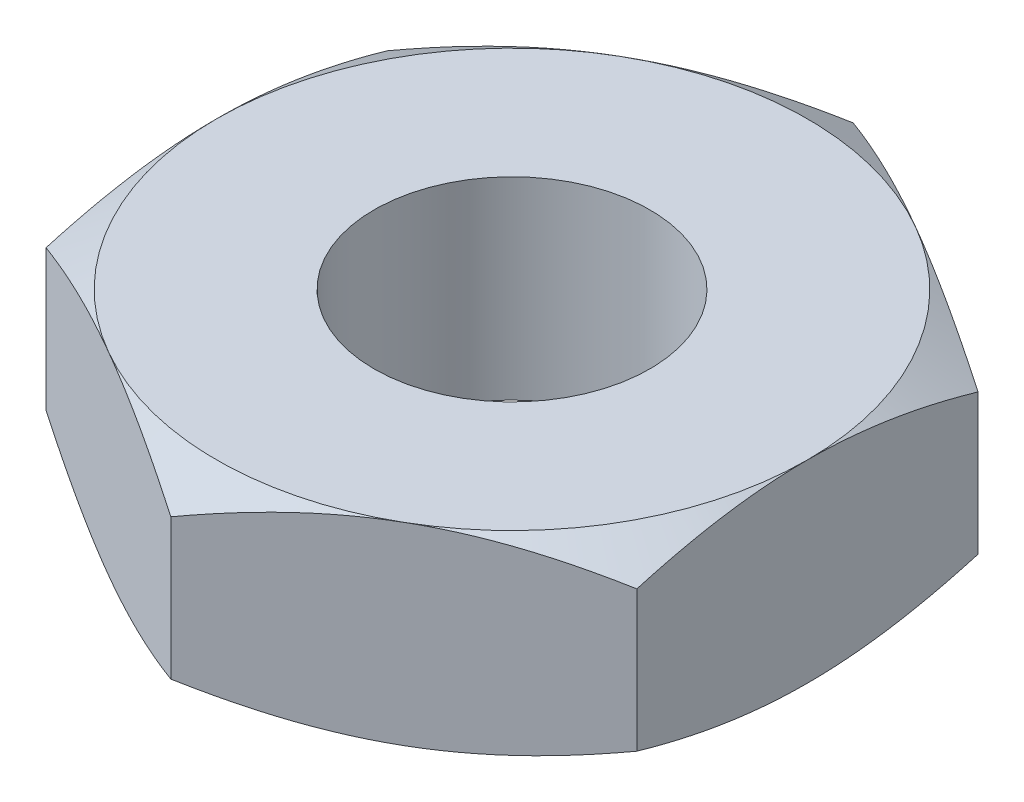
ISO-10303-21;
HEADER;
FILE_DESCRIPTION(('STEP AP214'),'2;1');
FILE_NAME('part.step','',(''),(''),'','','');
FILE_SCHEMA(('AUTOMOTIVE_DESIGN { 1 0 10303 214 1 1 1 1 }'));
ENDSEC;
DATA;
#1=APPLICATION_CONTEXT('core data for automotive mechanical design processes');
#2=APPLICATION_PROTOCOL_DEFINITION('international standard','automotive_design',2000,#1);
#3=PRODUCT_CONTEXT('',#1,'mechanical');
#4=PRODUCT('Part','Part','',(#3));
#5=PRODUCT_RELATED_PRODUCT_CATEGORY('part','',(#4));
#6=PRODUCT_DEFINITION_FORMATION('','',#4);
#7=PRODUCT_DEFINITION_CONTEXT('part definition',#1,'design');
#8=PRODUCT_DEFINITION('design','',#6,#7);
#9=PRODUCT_DEFINITION_SHAPE('','',#8);
#10=(LENGTH_UNIT() NAMED_UNIT(*) SI_UNIT(.MILLI.,.METRE.));
#11=(NAMED_UNIT(*) PLANE_ANGLE_UNIT() SI_UNIT($,.RADIAN.));
#12=(NAMED_UNIT(*) SI_UNIT($,.STERADIAN.) SOLID_ANGLE_UNIT());
#13=UNCERTAINTY_MEASURE_WITH_UNIT(LENGTH_MEASURE(1.E-05),#10,'distance_accuracy_value','');
#14=(GEOMETRIC_REPRESENTATION_CONTEXT(3) GLOBAL_UNCERTAINTY_ASSIGNED_CONTEXT((#13)) GLOBAL_UNIT_ASSIGNED_CONTEXT((#10,
#11,#12)) REPRESENTATION_CONTEXT('',''));
#15=CARTESIAN_POINT('',(0.,0.,0.));
#16=DIRECTION('',(0.,0.,1.));
#17=DIRECTION('',(1.,0.,0.));
#18=AXIS2_PLACEMENT_3D('',#15,#16,#17);
#19=CARTESIAN_POINT('',(2.75,1.8,-1.58771324027147));
#20=DIRECTION('',(-0.5,0.,0.866025403784439));
#21=DIRECTION('',(0.866025403784439,0.,0.5));
#22=AXIS2_PLACEMENT_3D('',#19,#20,#21);
#23=PLANE('',#22);
#24=DIRECTION('',(0.,-1.,0.));
#25=VECTOR('',#24,1.);
#26=CARTESIAN_POINT('',(2.75,1.8,-1.58771324027147));
#27=LINE('',#26,#25);
#28=CARTESIAN_POINT('',(2.75,1.55437990693814,-1.58771324027147));
#29=VERTEX_POINT('',#28);
#30=CARTESIAN_POINT('',(2.75,0.245620093061858,-1.58771324027147));
#31=VERTEX_POINT('',#30);
#32=EDGE_CURVE('E159',#29,#31,#27,.T.);
#33=ORIENTED_EDGE('',*,*,#32,.T.);
#34=CARTESIAN_POINT('',(2.7502,0.245686763364757,-1.58759777021763));
#35=CARTESIAN_POINT('',(2.62935077934009,0.20538766224926,-1.65737010029698));
#36=CARTESIAN_POINT('',(2.50745839737737,0.168736902597659,-1.72774469983533));
#37=CARTESIAN_POINT('',(2.26156287327211,0.104762182969799,-1.86971254687002));
#38=CARTESIAN_POINT('',(2.13755536142615,0.0774608556744955,-1.94130831721583));
#39=CARTESIAN_POINT('',(1.89107720202406,0.0349617452941153,-2.08361254889599));
#40=CARTESIAN_POINT('',(1.76864448141258,0.0194811186224564,-2.15429911309864));
#41=CARTESIAN_POINT('',(1.52320285763109,0.00099939736993891,-2.29600490065922));
#42=CARTESIAN_POINT('',(1.40019484676709,-0.00201700053740207,-2.36702360884403));
#43=CARTESIAN_POINT('',(1.17034121338921,0.00425314542854469,-2.49972966594897));
#44=CARTESIAN_POINT('',(1.06346120874598,0.0120001542767004,-2.56143686540072));
#45=CARTESIAN_POINT('',(0.850397532665252,0.0365551810643526,-2.68444923614046));
#46=CARTESIAN_POINT('',(0.744214598351112,0.053371589650568,-2.74575398185008));
#47=CARTESIAN_POINT('',(0.530711510606817,0.0954119223459535,-2.86902004703206));
#48=CARTESIAN_POINT('',(0.423418383857145,0.120814080687228,-2.93096576264318));
#49=CARTESIAN_POINT('',(0.210432520715949,0.178467225839978,-3.05393320806133));
#50=CARTESIAN_POINT('',(0.104737054973347,0.210704663298978,-3.11495651365995));
#51=CARTESIAN_POINT('',(-0.000200000000000443,0.245686763364756,-3.17554195059678));
#52=B_SPLINE_CURVE_WITH_KNOTS('',3,(#34,#35,#36,#37,#38,#39,#40,#41,#42,#43,#44,#45,#46,#47,#48,
#49,#50,#51),.UNSPECIFIED.,.F.,.F.,(4,2,2,2,2,2,2,2,4),(0.,0.435912828725887,0.87287355711633,
1.29901931904671,1.72464171213573,2.09526089052937,2.46622354066374,2.84541551798557,
3.22386274754524),.UNSPECIFIED.);
#53=CARTESIAN_POINT('',(1.375,0.,-2.38156986040721));
#54=VERTEX_POINT('',#53);
#55=EDGE_CURVE('E62',#31,#54,#52,.T.);
#56=ORIENTED_EDGE('',*,*,#55,.T.);
#57=CARTESIAN_POINT('',(0.,0.245620093061858,-3.17542648054294));
#58=VERTEX_POINT('',#57);
#59=EDGE_CURVE('E129',#54,#58,#52,.T.);
#60=ORIENTED_EDGE('',*,*,#59,.T.);
#61=DIRECTION('',(0.,-1.,0.));
#62=VECTOR('',#61,1.);
#63=CARTESIAN_POINT('',(0.,1.8,-3.17542648054294));
#64=LINE('',#63,#62);
#65=CARTESIAN_POINT('',(0.,1.55437990693814,-3.17542648054294));
#66=VERTEX_POINT('',#65);
#67=EDGE_CURVE('E267',#66,#58,#64,.T.);
#68=ORIENTED_EDGE('',*,*,#67,.F.);
#69=CARTESIAN_POINT('',(-0.000200000000000084,1.55431323663524,-3.17554195059678));
#70=CARTESIAN_POINT('',(0.120649220659906,1.59461233775074,-3.10576962051742));
#71=CARTESIAN_POINT('',(0.242541602622633,1.63126309740234,-3.03539502097908));
#72=CARTESIAN_POINT('',(0.488437126727892,1.6952378170302,-2.89342717394438));
#73=CARTESIAN_POINT('',(0.612444638573855,1.72253914432551,-2.82183140359858));
#74=CARTESIAN_POINT('',(0.858922797975943,1.76503825470589,-2.67952717191842));
#75=CARTESIAN_POINT('',(0.981355518587416,1.78051888137754,-2.60884060771577));
#76=CARTESIAN_POINT('',(1.22679714236891,1.79900060263006,-2.46713482015518));
#77=CARTESIAN_POINT('',(1.34980515323291,1.8020170005374,-2.39611611197037));
#78=CARTESIAN_POINT('',(1.57965878661079,1.79574685457146,-2.26341005486544));
#79=CARTESIAN_POINT('',(1.68653879125402,1.7879998457233,-2.20170285541368));
#80=CARTESIAN_POINT('',(1.89960246733475,1.76344481893565,-2.07869048467394));
#81=CARTESIAN_POINT('',(2.00578540164889,1.74662841034943,-2.01738573896433));
#82=CARTESIAN_POINT('',(2.21928848939318,1.70458807765405,-1.89411967378235));
#83=CARTESIAN_POINT('',(2.32658161614285,1.67918591931277,-1.83217395817123));
#84=CARTESIAN_POINT('',(2.53956747928405,1.62153277416002,-1.70920651275307));
#85=CARTESIAN_POINT('',(2.64526294502665,1.58929533670102,-1.64818320715446));
#86=CARTESIAN_POINT('',(2.7502,1.55431323663524,-1.58759777021763));
#87=B_SPLINE_CURVE_WITH_KNOTS('',3,(#69,#70,#71,#72,#73,#74,#75,#76,#77,#78,#79,#80,#81,#82,#83,
#84,#85,#86),.UNSPECIFIED.,.F.,.F.,(4,2,2,2,2,2,2,2,4),(0.,0.435912828725887,0.872873557116331,
1.29901931904671,1.72464171213573,2.09526089052937,2.46622354066374,2.84541551798557,
3.22386274754524),.UNSPECIFIED.);
#88=CARTESIAN_POINT('',(1.375,1.8,-2.38156986040721));
#89=VERTEX_POINT('',#88);
#90=EDGE_CURVE('E299',#66,#89,#87,.T.);
#91=ORIENTED_EDGE('',*,*,#90,.T.);
#92=EDGE_CURVE('E308',#89,#29,#87,.T.);
#93=ORIENTED_EDGE('',*,*,#92,.T.);
#94=EDGE_LOOP('',(#33,#56,#60,#68,#91,#93));
#95=FACE_BOUND('',#94,.T.);
#96=ADVANCED_FACE('F39',(#95),#23,.F.);
#97=CARTESIAN_POINT('',(0.,1.8,-3.17542648054294));
#98=DIRECTION('',(0.5,0.,0.866025403784439));
#99=DIRECTION('',(0.866025403784439,0.,-0.5));
#100=AXIS2_PLACEMENT_3D('',#97,#98,#99);
#101=PLANE('',#100);
#102=ORIENTED_EDGE('',*,*,#67,.T.);
#103=CARTESIAN_POINT('',(0.000199999999999961,0.245686763364756,-3.17554195059678));
#104=CARTESIAN_POINT('',(-0.120649220659906,0.205387662249259,-3.10576962051742));
#105=CARTESIAN_POINT('',(-0.242541602622633,0.168736902597659,-3.03539502097908));
#106=CARTESIAN_POINT('',(-0.488437126727892,0.104762182969798,-2.89342717394438));
#107=CARTESIAN_POINT('',(-0.612444638573855,0.0774608556744951,-2.82183140359858));
#108=CARTESIAN_POINT('',(-0.858922797975942,0.034961745294115,-2.67952717191842));
#109=CARTESIAN_POINT('',(-0.981355518587416,0.019481118622456,-2.60884060771577));
#110=CARTESIAN_POINT('',(-1.22679714236891,0.000999397369938881,-2.46713482015518));
#111=CARTESIAN_POINT('',(-1.34980515323291,-0.00201700053740175,-2.39611611197037));
#112=CARTESIAN_POINT('',(-1.57965878661079,0.00425314542854518,-2.26341005486544));
#113=CARTESIAN_POINT('',(-1.68653879125402,0.0120001542767007,-2.20170285541369));
#114=CARTESIAN_POINT('',(-1.89960246733475,0.0365551810643529,-2.07869048467395));
#115=CARTESIAN_POINT('',(-2.00578540164889,0.0533715896505683,-2.01738573896433));
#116=CARTESIAN_POINT('',(-2.21928848939318,0.0954119223459539,-1.89411967378235));
#117=CARTESIAN_POINT('',(-2.32658161614285,0.120814080687228,-1.83217395817123));
#118=CARTESIAN_POINT('',(-2.53956747928405,0.178467225839979,-1.70920651275307));
#119=CARTESIAN_POINT('',(-2.64526294502665,0.210704663298979,-1.64818320715446));
#120=CARTESIAN_POINT('',(-2.7502,0.245686763364757,-1.58759777021763));
#121=B_SPLINE_CURVE_WITH_KNOTS('',3,(#103,#104,#105,#106,#107,#108,#109,#110,#111,#112,#113,
#114,#115,#116,#117,#118,#119,#120),.UNSPECIFIED.,.F.,.F.,(4,2,2,2,2,2,2,2,4),(0.,
0.435912828725887,0.87287355711633,1.29901931904671,1.72464171213573,2.09526089052937,
2.46622354066374,2.84541551798557,3.22386274754524),.UNSPECIFIED.);
#122=CARTESIAN_POINT('',(-1.375,0.,-2.38156986040721));
#123=VERTEX_POINT('',#122);
#124=EDGE_CURVE('E135',#58,#123,#121,.T.);
#125=ORIENTED_EDGE('',*,*,#124,.T.);
#126=CARTESIAN_POINT('',(-2.75,0.245620093061858,-1.58771324027147));
#127=VERTEX_POINT('',#126);
#128=EDGE_CURVE('E172',#123,#127,#121,.T.);
#129=ORIENTED_EDGE('',*,*,#128,.T.);
#130=DIRECTION('',(0.,-1.,0.));
#131=VECTOR('',#130,1.);
#132=CARTESIAN_POINT('',(-2.75,1.8,-1.58771324027147));
#133=LINE('',#132,#131);
#134=CARTESIAN_POINT('',(-2.75,1.55437990693814,-1.58771324027147));
#135=VERTEX_POINT('',#134);
#136=EDGE_CURVE('E263',#135,#127,#133,.T.);
#137=ORIENTED_EDGE('',*,*,#136,.F.);
#138=CARTESIAN_POINT('',(-2.7502,1.55431323663524,-1.58759777021763));
#139=CARTESIAN_POINT('',(-2.62935077934009,1.59461233775074,-1.65737010029698));
#140=CARTESIAN_POINT('',(-2.50745839737737,1.63126309740234,-1.72774469983533));
#141=CARTESIAN_POINT('',(-2.26156287327211,1.6952378170302,-1.86971254687002));
#142=CARTESIAN_POINT('',(-2.13755536142615,1.7225391443255,-1.94130831721583));
#143=CARTESIAN_POINT('',(-1.89107720202406,1.76503825470588,-2.08361254889599));
#144=CARTESIAN_POINT('',(-1.76864448141258,1.78051888137754,-2.15429911309864));
#145=CARTESIAN_POINT('',(-1.52320285763109,1.79900060263006,-2.29600490065922));
#146=CARTESIAN_POINT('',(-1.40019484676709,1.8020170005374,-2.36702360884403));
#147=CARTESIAN_POINT('',(-1.17034121338921,1.79574685457145,-2.49972966594897));
#148=CARTESIAN_POINT('',(-1.06346120874598,1.7879998457233,-2.56143686540072));
#149=CARTESIAN_POINT('',(-0.850397532665252,1.76344481893565,-2.68444923614046));
#150=CARTESIAN_POINT('',(-0.744214598351112,1.74662841034943,-2.74575398185008));
#151=CARTESIAN_POINT('',(-0.530711510606817,1.70458807765405,-2.86902004703206));
#152=CARTESIAN_POINT('',(-0.423418383857146,1.67918591931277,-2.93096576264318));
#153=CARTESIAN_POINT('',(-0.210432520715949,1.62153277416002,-3.05393320806133));
#154=CARTESIAN_POINT('',(-0.104737054973348,1.58929533670102,-3.11495651365995));
#155=CARTESIAN_POINT('',(0.000199999999999814,1.55431323663524,-3.17554195059678));
#156=B_SPLINE_CURVE_WITH_KNOTS('',3,(#138,#139,#140,#141,#142,#143,#144,#145,#146,#147,#148,
#149,#150,#151,#152,#153,#154,#155),.UNSPECIFIED.,.F.,.F.,(4,2,2,2,2,2,2,2,4),(0.,
0.435912828725887,0.87287355711633,1.29901931904671,1.72464171213573,2.09526089052937,
2.46622354066374,2.84541551798557,3.22386274754524),.UNSPECIFIED.);
#157=CARTESIAN_POINT('',(-1.375,1.8,-2.38156986040721));
#158=VERTEX_POINT('',#157);
#159=EDGE_CURVE('E336',#135,#158,#156,.T.);
#160=ORIENTED_EDGE('',*,*,#159,.T.);
#161=EDGE_CURVE('E236',#158,#66,#156,.T.);
#162=ORIENTED_EDGE('',*,*,#161,.T.);
#163=EDGE_LOOP('',(#102,#125,#129,#137,#160,#162));
#164=FACE_BOUND('',#163,.T.);
#165=ADVANCED_FACE('F220',(#164),#101,.F.);
#166=CARTESIAN_POINT('',(-2.75,1.8,-1.58771324027147));
#167=DIRECTION('',(1.,0.,0.));
#168=DIRECTION('',(0.,0.,-1.));
#169=AXIS2_PLACEMENT_3D('',#166,#167,#168);
#170=PLANE('',#169);
#171=ORIENTED_EDGE('',*,*,#136,.T.);
#172=CARTESIAN_POINT('',(-2.75,1.31594843960292,-4.21084949309675));
#173=CARTESIAN_POINT('',(-2.75,1.25759993615222,-4.09010894214089));
#174=CARTESIAN_POINT('',(-2.75,1.19983146511756,-3.96908292065508));
#175=CARTESIAN_POINT('',(-2.75,1.08578603842303,-3.72630558284843));
#176=CARTESIAN_POINT('',(-2.75,1.02950934100245,-3.604554145362));
#177=CARTESIAN_POINT('',(-2.75,0.918482443352741,-3.35951393034354));
#178=CARTESIAN_POINT('',(-2.75,0.863742821605822,-3.23622034236436));
#179=CARTESIAN_POINT('',(-2.75,0.75661477747644,-2.98861980138743));
#180=CARTESIAN_POINT('',(-2.75,0.70422623253675,-2.86431290161181));
#181=CARTESIAN_POINT('',(-2.75,0.601803572146112,-2.61294485887171));
#182=CARTESIAN_POINT('',(-2.75,0.551806257898382,-2.48586863815654));
#183=CARTESIAN_POINT('',(-2.75,0.455727408784592,-2.2302173217154));
#184=CARTESIAN_POINT('',(-2.75,0.409646309576963,-2.10164206103363));
#185=CARTESIAN_POINT('',(-2.75,0.322638077046224,-1.84305218799467));
#186=CARTESIAN_POINT('',(-2.75,0.281699986413882,-1.71304130052583));
#187=CARTESIAN_POINT('',(-2.75,0.206307307624344,-1.45117125062147));
#188=CARTESIAN_POINT('',(-2.75,0.171850669152763,-1.31931268690202));
#189=CARTESIAN_POINT('',(-2.75,0.111093671530901,-1.05365722480012));
#190=CARTESIAN_POINT('',(-2.75,0.0847954840951194,-0.919859820217587));
#191=CARTESIAN_POINT('',(-2.75,0.04212603719661,-0.650651874037378));
#192=CARTESIAN_POINT('',(-2.75,0.0257547865105423,-0.515241331013592));
#193=CARTESIAN_POINT('',(-2.75,0.00438749654023722,-0.244373242869208));
#194=CARTESIAN_POINT('',(-2.75,-0.000680556773216046,-0.108921526377131));
#195=CARTESIAN_POINT('',(-2.75,0.000827795632672014,0.161887058855136));
#196=CARTESIAN_POINT('',(-2.75,0.00740117868555372,0.297243943089642));
#197=CARTESIAN_POINT('',(-2.75,0.0281041300468438,0.528385436717545));
#198=CARTESIAN_POINT('',(-2.75,0.0395376410301884,0.624425050137505));
#199=CARTESIAN_POINT('',(-2.75,0.0675217196133515,0.815762399811552));
#200=CARTESIAN_POINT('',(-2.75,0.084073094227683,0.911060016631976));
#201=CARTESIAN_POINT('',(-2.75,0.140535361278286,1.19576218748918));
#202=CARTESIAN_POINT('',(-2.75,0.187239859417296,1.38383224738499));
#203=CARTESIAN_POINT('',(-2.75,0.267792497030582,1.66525048947488));
#204=CARTESIAN_POINT('',(-2.75,0.296803334995505,1.76006556248561));
#205=CARTESIAN_POINT('',(-2.75,0.357695648906593,1.94870609382218));
#206=CARTESIAN_POINT('',(-2.75,0.389575144878509,2.04253218553699));
#207=CARTESIAN_POINT('',(-2.75,0.455541418186454,2.22880240354988));
#208=CARTESIAN_POINT('',(-2.75,0.489614761455539,2.32125133588455));
#209=CARTESIAN_POINT('',(-2.75,0.559761368231117,2.50543192042633));
#210=CARTESIAN_POINT('',(-2.75,0.595835440037326,2.59716326539583));
#211=CARTESIAN_POINT('',(-2.75,0.632712441997492,2.6885629305335));
#212=B_SPLINE_CURVE_WITH_KNOTS('',3,(#172,#173,#174,#175,#176,#177,#178,#179,#180,#181,#182,
#183,#184,#185,#186,#187,#188,#189,#190,#191,#192,#193,#194,#195,#196,#197,#198,#199,#200,#201,
#202,#203,#204,#205,#206,#207,#208,#209,#210,#211),.UNSPECIFIED.,.F.,.F.,(4,2,2,2,2,2,2,2,2,2,2,
2,2,2,2,2,2,2,2,4),(0.,0.402305607365935,0.804680408536995,1.20935783819118,1.61401414820818,
2.02363838185769,2.43330812457348,2.842089694796,3.25074173456635,3.65950246109142,
4.06826354901183,4.47441284024649,4.88045669141171,5.17046846817545,5.46052599902452,
6.04107275309884,6.33851131304663,6.63574613017457,6.93130791005795,7.22698998004826),.UNSPECIFIED.);
#213=CARTESIAN_POINT('',(-2.75,0.,0.));
#214=VERTEX_POINT('',#213);
#215=EDGE_CURVE('E214',#127,#214,#212,.T.);
#216=ORIENTED_EDGE('',*,*,#215,.T.);
#217=CARTESIAN_POINT('',(-2.74999999999999,0.245620093061858,1.58771324027148));
#218=VERTEX_POINT('',#217);
#219=EDGE_CURVE('E207',#214,#218,#212,.T.);
#220=ORIENTED_EDGE('',*,*,#219,.T.);
#221=DIRECTION('',(0.,-1.,0.));
#222=VECTOR('',#221,1.);
#223=CARTESIAN_POINT('',(-2.75,1.8,1.58771324027147));
#224=LINE('',#223,#222);
#225=CARTESIAN_POINT('',(-2.75,1.55437990693814,1.58771324027148));
#226=VERTEX_POINT('',#225);
#227=EDGE_CURVE('E259',#226,#218,#224,.T.);
#228=ORIENTED_EDGE('',*,*,#227,.F.);
#229=CARTESIAN_POINT('',(-2.75,0.484051560397082,-4.21084949309675));
#230=CARTESIAN_POINT('',(-2.75,0.542400063847779,-4.09010894214089));
#231=CARTESIAN_POINT('',(-2.75,0.600168534882435,-3.96908292065509));
#232=CARTESIAN_POINT('',(-2.75,0.714213961576969,-3.72630558284843));
#233=CARTESIAN_POINT('',(-2.75,0.770490658997547,-3.604554145362));
#234=CARTESIAN_POINT('',(-2.75,0.881517556647259,-3.35951393034354));
#235=CARTESIAN_POINT('',(-2.75,0.936257178394178,-3.23622034236436));
#236=CARTESIAN_POINT('',(-2.75,1.04338522252356,-2.98861980138743));
#237=CARTESIAN_POINT('',(-2.75,1.09577376746325,-2.86431290161181));
#238=CARTESIAN_POINT('',(-2.75,1.19819642785389,-2.61294485887171));
#239=CARTESIAN_POINT('',(-2.75,1.24819374210162,-2.48586863815653));
#240=CARTESIAN_POINT('',(-2.75,1.34427259121541,-2.2302173217154));
#241=CARTESIAN_POINT('',(-2.75,1.39035369042304,-2.10164206103363));
#242=CARTESIAN_POINT('',(-2.75,1.47736192295378,-1.84305218799467));
#243=CARTESIAN_POINT('',(-2.75,1.51830001358612,-1.71304130052583));
#244=CARTESIAN_POINT('',(-2.75,1.59369269237566,-1.45117125062147));
#245=CARTESIAN_POINT('',(-2.75,1.62814933084724,-1.31931268690202));
#246=CARTESIAN_POINT('',(-2.75,1.6889063284691,-1.05365722480012));
#247=CARTESIAN_POINT('',(-2.75,1.71520451590488,-0.919859820217587));
#248=CARTESIAN_POINT('',(-2.75,1.75787396280339,-0.650651874037377));
#249=CARTESIAN_POINT('',(-2.75,1.77424521348946,-0.515241331013591));
#250=CARTESIAN_POINT('',(-2.75,1.79561250345976,-0.244373242869208));
#251=CARTESIAN_POINT('',(-2.75,1.80068055677322,-0.108921526377131));
#252=CARTESIAN_POINT('',(-2.75,1.79917220436733,0.161887058855136));
#253=CARTESIAN_POINT('',(-2.75,1.79259882131445,0.297243943089642));
#254=CARTESIAN_POINT('',(-2.75,1.77189586995316,0.528385436717545));
#255=CARTESIAN_POINT('',(-2.75,1.76046235896981,0.624425050137505));
#256=CARTESIAN_POINT('',(-2.75,1.73247828038665,0.815762399811552));
#257=CARTESIAN_POINT('',(-2.75,1.71592690577232,0.911060016631976));
#258=CARTESIAN_POINT('',(-2.75,1.65946463872172,1.19576218748918));
#259=CARTESIAN_POINT('',(-2.75,1.61276014058271,1.38383224738498));
#260=CARTESIAN_POINT('',(-2.75,1.53220750296942,1.66525048947488));
#261=CARTESIAN_POINT('',(-2.75,1.5031966650045,1.7600655624856));
#262=CARTESIAN_POINT('',(-2.75,1.44230435109341,1.94870609382218));
#263=CARTESIAN_POINT('',(-2.75,1.41042485512149,2.04253218553699));
#264=CARTESIAN_POINT('',(-2.75,1.34445858181355,2.22880240354988));
#265=CARTESIAN_POINT('',(-2.75,1.31038523854446,2.32125133588455));
#266=CARTESIAN_POINT('',(-2.75,1.24023863176889,2.50543192042633));
#267=CARTESIAN_POINT('',(-2.75,1.20416455996268,2.59716326539583));
#268=CARTESIAN_POINT('',(-2.75,1.16728755800251,2.6885629305335));
#269=B_SPLINE_CURVE_WITH_KNOTS('',3,(#229,#230,#231,#232,#233,#234,#235,#236,#237,#238,#239,
#240,#241,#242,#243,#244,#245,#246,#247,#248,#249,#250,#251,#252,#253,#254,#255,#256,#257,#258,
#259,#260,#261,#262,#263,#264,#265,#266,#267,#268),.UNSPECIFIED.,.F.,.F.,(4,2,2,2,2,2,2,2,2,2,2,
2,2,2,2,2,2,2,2,4),(0.,0.402305607365936,0.804680408536996,1.20935783819118,1.61401414820818,
2.0236383818577,2.43330812457348,2.842089694796,3.25074173456636,3.65950246109143,
4.06826354901183,4.47441284024649,4.88045669141171,5.17046846817545,5.46052599902452,
6.04107275309884,6.33851131304663,6.63574613017457,6.93130791005795,7.22698998004826),.UNSPECIFIED.);
#270=CARTESIAN_POINT('',(-2.75,1.8,0.));
#271=VERTEX_POINT('',#270);
#272=EDGE_CURVE('E234',#226,#271,#269,.F.);
#273=ORIENTED_EDGE('',*,*,#272,.T.);
#274=EDGE_CURVE('E226',#271,#135,#269,.F.);
#275=ORIENTED_EDGE('',*,*,#274,.T.);
#276=EDGE_LOOP('',(#171,#216,#220,#228,#273,#275));
#277=FACE_BOUND('',#276,.T.);
#278=ADVANCED_FACE('F216',(#277),#170,.F.);
#279=CARTESIAN_POINT('',(-2.75,1.8,1.58771324027147));
#280=DIRECTION('',(0.5,0.,-0.866025403784439));
#281=DIRECTION('',(-0.866025403784439,0.,-0.5));
#282=AXIS2_PLACEMENT_3D('',#279,#280,#281);
#283=PLANE('',#282);
#284=ORIENTED_EDGE('',*,*,#227,.T.);
#285=CARTESIAN_POINT('',(-2.7502,0.245686763364758,1.58759777021764));
#286=CARTESIAN_POINT('',(-2.62935077934009,0.205387662249261,1.65737010029699));
#287=CARTESIAN_POINT('',(-2.50745839737737,0.168736902597661,1.72774469983533));
#288=CARTESIAN_POINT('',(-2.26156287327211,0.1047621829698,1.86971254687003));
#289=CARTESIAN_POINT('',(-2.13755536142614,0.0774608556744973,1.94130831721583));
#290=CARTESIAN_POINT('',(-1.89107720202406,0.0349617452941174,2.08361254889599));
#291=CARTESIAN_POINT('',(-1.76864448141258,0.0194811186224584,2.15429911309864));
#292=CARTESIAN_POINT('',(-1.52320285763109,0.000999397369941331,2.29600490065923));
#293=CARTESIAN_POINT('',(-1.40019484676709,-0.00201700053739932,2.36702360884404));
#294=CARTESIAN_POINT('',(-1.17034121338921,0.00425314542854779,2.49972966594897));
#295=CARTESIAN_POINT('',(-1.06346120874598,0.0120001542767035,2.56143686540073));
#296=CARTESIAN_POINT('',(-0.850397532665251,0.0365551810643558,2.68444923614047));
#297=CARTESIAN_POINT('',(-0.744214598351111,0.0533715896505712,2.74575398185008));
#298=CARTESIAN_POINT('',(-0.530711510606816,0.0954119223459568,2.86902004703207));
#299=CARTESIAN_POINT('',(-0.423418383857145,0.120814080687231,2.93096576264319));
#300=CARTESIAN_POINT('',(-0.210432520715949,0.178467225839982,3.05393320806134));
#301=CARTESIAN_POINT('',(-0.104737054973347,0.210704663298982,3.11495651365995));
#302=CARTESIAN_POINT('',(0.000200000000000377,0.245686763364759,3.17554195059678));
#303=B_SPLINE_CURVE_WITH_KNOTS('',3,(#285,#286,#287,#288,#289,#290,#291,#292,#293,#294,#295,
#296,#297,#298,#299,#300,#301,#302),.UNSPECIFIED.,.F.,.F.,(4,2,2,2,2,2,2,2,4),(0.,
0.435912828725888,0.872873557116331,1.29901931904671,1.72464171213573,2.09526089052937,
2.46622354066374,2.84541551798557,3.22386274754524),.UNSPECIFIED.);
#304=CARTESIAN_POINT('',(-1.375,0.,2.38156986040721));
#305=VERTEX_POINT('',#304);
#306=EDGE_CURVE('E215',#218,#305,#303,.T.);
#307=ORIENTED_EDGE('',*,*,#306,.T.);
#308=CARTESIAN_POINT('',(0.,0.245620093061858,3.17542648054294));
#309=VERTEX_POINT('',#308);
#310=EDGE_CURVE('E202',#305,#309,#303,.T.);
#311=ORIENTED_EDGE('',*,*,#310,.T.);
#312=DIRECTION('',(0.,-1.,0.));
#313=VECTOR('',#312,1.);
#314=CARTESIAN_POINT('',(0.,1.8,3.17542648054294));
#315=LINE('',#314,#313);
#316=CARTESIAN_POINT('',(0.,1.55437990693814,3.17542648054294));
#317=VERTEX_POINT('',#316);
#318=EDGE_CURVE('E255',#317,#309,#315,.T.);
#319=ORIENTED_EDGE('',*,*,#318,.F.);
#320=CARTESIAN_POINT('',(0.000200000000000199,1.55431323663524,3.17554195059678));
#321=CARTESIAN_POINT('',(-0.120649220659905,1.59461233775074,3.10576962051743));
#322=CARTESIAN_POINT('',(-0.242541602622633,1.63126309740234,3.03539502097908));
#323=CARTESIAN_POINT('',(-0.488437126727892,1.6952378170302,2.89342717394439));
#324=CARTESIAN_POINT('',(-0.612444638573855,1.7225391443255,2.82183140359859));
#325=CARTESIAN_POINT('',(-0.858922797975943,1.76503825470588,2.67952717191843));
#326=CARTESIAN_POINT('',(-0.981355518587416,1.78051888137754,2.60884060771578));
#327=CARTESIAN_POINT('',(-1.22679714236891,1.79900060263006,2.46713482015519));
#328=CARTESIAN_POINT('',(-1.34980515323291,1.8020170005374,2.39611611197038));
#329=CARTESIAN_POINT('',(-1.57965878661079,1.79574685457145,2.26341005486545));
#330=CARTESIAN_POINT('',(-1.68653879125402,1.7879998457233,2.20170285541369));
#331=CARTESIAN_POINT('',(-1.89960246733475,1.76344481893565,2.07869048467395));
#332=CARTESIAN_POINT('',(-2.00578540164889,1.74662841034943,2.01738573896434));
#333=CARTESIAN_POINT('',(-2.21928848939318,1.70458807765405,1.89411967378235));
#334=CARTESIAN_POINT('',(-2.32658161614285,1.67918591931277,1.83217395817123));
#335=CARTESIAN_POINT('',(-2.53956747928405,1.62153277416002,1.70920651275308));
#336=CARTESIAN_POINT('',(-2.64526294502665,1.58929533670102,1.64818320715446));
#337=CARTESIAN_POINT('',(-2.7502,1.55431323663524,1.58759777021764));
#338=B_SPLINE_CURVE_WITH_KNOTS('',3,(#320,#321,#322,#323,#324,#325,#326,#327,#328,#329,#330,
#331,#332,#333,#334,#335,#336,#337),.UNSPECIFIED.,.F.,.F.,(4,2,2,2,2,2,2,2,4),(0.,
0.435912828725888,0.872873557116331,1.29901931904671,1.72464171213573,2.09526089052937,
2.46622354066374,2.84541551798557,3.22386274754524),.UNSPECIFIED.);
#339=CARTESIAN_POINT('',(-1.375,1.8,2.38156986040721));
#340=VERTEX_POINT('',#339);
#341=EDGE_CURVE('E316',#317,#340,#338,.T.);
#342=ORIENTED_EDGE('',*,*,#341,.T.);
#343=EDGE_CURVE('E235',#340,#226,#338,.T.);
#344=ORIENTED_EDGE('',*,*,#343,.T.);
#345=EDGE_LOOP('',(#284,#307,#311,#319,#342,#344));
#346=FACE_BOUND('',#345,.T.);
#347=ADVANCED_FACE('F219',(#346),#283,.F.);
#348=CARTESIAN_POINT('',(0.,1.8,3.17542648054294));
#349=DIRECTION('',(-0.5,0.,-0.866025403784439));
#350=DIRECTION('',(-0.866025403784439,0.,0.5));
#351=AXIS2_PLACEMENT_3D('',#348,#349,#350);
#352=PLANE('',#351);
#353=ORIENTED_EDGE('',*,*,#318,.T.);
#354=CARTESIAN_POINT('',(-0.000199999999999858,0.245686763364759,3.17554195059678));
#355=CARTESIAN_POINT('',(0.120649220659906,0.205387662249262,3.10576962051743));
#356=CARTESIAN_POINT('',(0.242541602622634,0.168736902597662,3.03539502097908));
#357=CARTESIAN_POINT('',(0.488437126727893,0.104762182969801,2.89342717394439));
#358=CARTESIAN_POINT('',(0.612444638573856,0.0774608556744981,2.82183140359859));
#359=CARTESIAN_POINT('',(0.858922797975944,0.034961745294118,2.67952717191843));
#360=CARTESIAN_POINT('',(0.981355518587418,0.0194811186224592,2.60884060771578));
#361=CARTESIAN_POINT('',(1.22679714236892,0.00099939736994209,2.46713482015519));
#362=CARTESIAN_POINT('',(1.34980515323291,-0.00201700053739859,2.39611611197038));
#363=CARTESIAN_POINT('',(1.57965878661079,0.00425314542854836,2.26341005486545));
#364=CARTESIAN_POINT('',(1.68653879125402,0.0120001542767039,2.20170285541369));
#365=CARTESIAN_POINT('',(1.89960246733475,0.036555181064356,2.07869048467395));
#366=CARTESIAN_POINT('',(2.00578540164889,0.0533715896505713,2.01738573896434));
#367=CARTESIAN_POINT('',(2.21928848939318,0.0954119223459566,1.89411967378235));
#368=CARTESIAN_POINT('',(2.32658161614285,0.120814080687231,1.83217395817123));
#369=CARTESIAN_POINT('',(2.53956747928405,0.178467225839981,1.70920651275308));
#370=CARTESIAN_POINT('',(2.64526294502665,0.210704663298981,1.64818320715447));
#371=CARTESIAN_POINT('',(2.7502,0.245686763364758,1.58759777021764));
#372=B_SPLINE_CURVE_WITH_KNOTS('',3,(#354,#355,#356,#357,#358,#359,#360,#361,#362,#363,#364,
#365,#366,#367,#368,#369,#370,#371),.UNSPECIFIED.,.F.,.F.,(4,2,2,2,2,2,2,2,4),(0.,
0.435912828725888,0.872873557116332,1.29901931904671,1.72464171213574,2.09526089052937,
2.46622354066374,2.84541551798557,3.22386274754524),.UNSPECIFIED.);
#373=CARTESIAN_POINT('',(1.375,0.,2.38156986040721));
#374=VERTEX_POINT('',#373);
#375=EDGE_CURVE('E353',#309,#374,#372,.T.);
#376=ORIENTED_EDGE('',*,*,#375,.T.);
#377=CARTESIAN_POINT('',(2.75,0.245620093061858,1.58771324027147));
#378=VERTEX_POINT('',#377);
#379=EDGE_CURVE('E195',#374,#378,#372,.T.);
#380=ORIENTED_EDGE('',*,*,#379,.T.);
#381=DIRECTION('',(0.,-1.,0.));
#382=VECTOR('',#381,1.);
#383=CARTESIAN_POINT('',(2.75,1.8,1.58771324027148));
#384=LINE('',#383,#382);
#385=CARTESIAN_POINT('',(2.75,1.55437990693814,1.58771324027148));
#386=VERTEX_POINT('',#385);
#387=EDGE_CURVE('E251',#386,#378,#384,.T.);
#388=ORIENTED_EDGE('',*,*,#387,.F.);
#389=CARTESIAN_POINT('',(2.7502,1.55431323663524,1.58759777021764));
#390=CARTESIAN_POINT('',(2.62935077934009,1.59461233775074,1.65737010029699));
#391=CARTESIAN_POINT('',(2.50745839737737,1.63126309740234,1.72774469983534));
#392=CARTESIAN_POINT('',(2.26156287327211,1.6952378170302,1.86971254687003));
#393=CARTESIAN_POINT('',(2.13755536142614,1.7225391443255,1.94130831721583));
#394=CARTESIAN_POINT('',(1.89107720202406,1.76503825470588,2.08361254889599));
#395=CARTESIAN_POINT('',(1.76864448141258,1.78051888137754,2.15429911309865));
#396=CARTESIAN_POINT('',(1.52320285763108,1.79900060263006,2.29600490065923));
#397=CARTESIAN_POINT('',(1.40019484676709,1.8020170005374,2.36702360884404));
#398=CARTESIAN_POINT('',(1.17034121338921,1.79574685457145,2.49972966594897));
#399=CARTESIAN_POINT('',(1.06346120874598,1.7879998457233,2.56143686540073));
#400=CARTESIAN_POINT('',(0.850397532665251,1.76344481893565,2.68444923614047));
#401=CARTESIAN_POINT('',(0.744214598351111,1.74662841034943,2.74575398185008));
#402=CARTESIAN_POINT('',(0.530711510606816,1.70458807765405,2.86902004703207));
#403=CARTESIAN_POINT('',(0.423418383857145,1.67918591931277,2.93096576264319));
#404=CARTESIAN_POINT('',(0.210432520715949,1.62153277416002,3.05393320806134));
#405=CARTESIAN_POINT('',(0.104737054973348,1.58929533670102,3.11495651365995));
#406=CARTESIAN_POINT('',(-0.000199999999999715,1.55431323663524,3.17554195059678));
#407=B_SPLINE_CURVE_WITH_KNOTS('',3,(#389,#390,#391,#392,#393,#394,#395,#396,#397,#398,#399,
#400,#401,#402,#403,#404,#405,#406),.UNSPECIFIED.,.F.,.F.,(4,2,2,2,2,2,2,2,4),(0.,
0.435912828725888,0.872873557116331,1.29901931904671,1.72464171213573,2.09526089052937,
2.46622354066374,2.84541551798557,3.22386274754524),.UNSPECIFIED.);
#408=CARTESIAN_POINT('',(1.375,1.8,2.38156986040721));
#409=VERTEX_POINT('',#408);
#410=EDGE_CURVE('E318',#386,#409,#407,.T.);
#411=ORIENTED_EDGE('',*,*,#410,.T.);
#412=EDGE_CURVE('E310',#409,#317,#407,.T.);
#413=ORIENTED_EDGE('',*,*,#412,.T.);
#414=EDGE_LOOP('',(#353,#376,#380,#388,#411,#413));
#415=FACE_BOUND('',#414,.T.);
#416=ADVANCED_FACE('F367',(#415),#352,.F.);
#417=CARTESIAN_POINT('',(2.75,1.8,1.58771324027148));
#418=DIRECTION('',(-1.,0.,0.));
#419=DIRECTION('',(0.,0.,1.));
#420=AXIS2_PLACEMENT_3D('',#417,#418,#419);
#421=PLANE('',#420);
#422=ORIENTED_EDGE('',*,*,#387,.T.);
#423=CARTESIAN_POINT('',(2.75,1.31594891408977,-4.21085047466774));
#424=CARTESIAN_POINT('',(2.75,1.25760039033706,-4.09010989011094));
#425=CARTESIAN_POINT('',(2.75,1.19983189901234,-3.96908383499852));
#426=CARTESIAN_POINT('',(2.75,1.08578643184574,-3.72630642982621));
#427=CARTESIAN_POINT('',(2.75,1.02950971424318,-3.60455495860071));
#428=CARTESIAN_POINT('',(2.75,0.918482776219311,-3.35951467553997));
#429=CARTESIAN_POINT('',(2.75,0.863743134284529,-3.23622105325521));
#430=CARTESIAN_POINT('',(2.75,0.7566150501509,-2.98862044341193));
#431=CARTESIAN_POINT('',(2.75,0.704226485394789,-2.86431350907558));
#432=CARTESIAN_POINT('',(2.75,0.601803785712119,-2.61294539628322));
#433=CARTESIAN_POINT('',(2.75,0.551806451999386,-2.48586914007059));
#434=CARTESIAN_POINT('',(2.75,0.455727565035128,-2.23021775204036));
#435=CARTESIAN_POINT('',(2.75,0.409646447442418,-2.1016424552668));
#436=CARTESIAN_POINT('',(2.75,0.322638179971965,-1.84305250936245));
#437=CARTESIAN_POINT('',(2.75,0.281700072779022,-1.7130415851225));
#438=CARTESIAN_POINT('',(2.75,0.206307363670479,-1.45117146066373));
#439=CARTESIAN_POINT('',(2.75,0.171850711438671,-1.31931285916158));
#440=CARTESIAN_POINT('',(2.75,0.111093685978182,-1.05365730058872));
#441=CARTESIAN_POINT('',(2.75,0.084795485676615,-0.919859837035216));
#442=CARTESIAN_POINT('',(2.75,0.042126022040423,-0.6506517715884));
#443=CARTESIAN_POINT('',(2.75,0.0257547674760033,-0.515241168270025));
#444=CARTESIAN_POINT('',(2.75,0.00438748036256761,-0.244372959827886));
#445=CARTESIAN_POINT('',(2.75,-0.000680566304422186,-0.108921183336601));
#446=CARTESIAN_POINT('',(2.75,0.000827809639781124,0.161887520872989));
#447=CARTESIAN_POINT('',(2.75,0.00740120958679076,0.297244464085861));
#448=CARTESIAN_POINT('',(2.75,0.0281041947704403,0.528386033126795));
#449=CARTESIAN_POINT('',(2.75,0.0395377192911566,0.624425663637143));
#450=CARTESIAN_POINT('',(2.75,0.0675218256946278,0.815763046774004));
#451=CARTESIAN_POINT('',(2.75,0.0840732145920206,0.911060679966739));
#452=CARTESIAN_POINT('',(2.75,0.14053552483902,1.19576289915277));
#453=CARTESIAN_POINT('',(2.75,0.187240052210049,1.38383299011475));
#454=CARTESIAN_POINT('',(2.75,0.267792733064851,1.66525127863568));
#455=CARTESIAN_POINT('',(2.75,0.296803585547794,1.76006636738016));
#456=CARTESIAN_POINT('',(2.75,0.357695928076052,1.94870693000561));
#457=CARTESIAN_POINT('',(2.75,0.389575438146926,2.04253303727579));
#458=CARTESIAN_POINT('',(2.75,0.455541739100763,2.22880328617383));
#459=CARTESIAN_POINT('',(2.75,0.489615095917175,2.32125223383934));
#460=CARTESIAN_POINT('',(2.75,0.559761729379381,2.5054328490763));
#461=CARTESIAN_POINT('',(2.75,0.595835814325322,2.59716420940992));
#462=CARTESIAN_POINT('',(2.75,0.632712829223351,2.68856388993767));
#463=B_SPLINE_CURVE_WITH_KNOTS('',3,(#423,#424,#425,#426,#427,#428,#429,#430,#431,#432,#433,
#434,#435,#436,#437,#438,#439,#440,#441,#442,#443,#444,#445,#446,#447,#448,#449,#450,#451,#452,
#453,#454,#455,#456,#457,#458,#459,#460,#461,#462),.UNSPECIFIED.,.F.,.F.,(4,2,2,2,2,2,2,2,2,2,2,
2,2,2,2,2,2,2,2,4),(0.,0.402305724628122,0.804680643080821,1.20935819137344,1.61401462001939,
2.02363897413607,2.43330883735973,2.84209052765639,3.25074268740349,3.6595035945605,
4.06826486284692,4.47441433252271,4.88045836225495,5.17047019471949,5.46052778127857,
6.04107464708557,6.33851326493238,6.63574813987144,6.93130997697814,7.22699210430481),.UNSPECIFIED.);
#464=CARTESIAN_POINT('',(2.75,0.,0.));
#465=VERTEX_POINT('',#464);
#466=EDGE_CURVE('E354',#378,#465,#463,.F.);
#467=ORIENTED_EDGE('',*,*,#466,.T.);
#468=EDGE_CURVE('E144',#465,#31,#463,.F.);
#469=ORIENTED_EDGE('',*,*,#468,.T.);
#470=ORIENTED_EDGE('',*,*,#32,.F.);
#471=CARTESIAN_POINT('',(2.75,0.484051085910234,-4.21085047466774));
#472=CARTESIAN_POINT('',(2.75,0.542399609662936,-4.09010989011094));
#473=CARTESIAN_POINT('',(2.75,0.600168100987656,-3.96908383499852));
#474=CARTESIAN_POINT('',(2.75,0.714213568154259,-3.72630642982621));
#475=CARTESIAN_POINT('',(2.75,0.770490285756824,-3.60455495860072));
#476=CARTESIAN_POINT('',(2.75,0.881517223780689,-3.35951467553998));
#477=CARTESIAN_POINT('',(2.75,0.936256865715471,-3.23622105325521));
#478=CARTESIAN_POINT('',(2.75,1.0433849498491,-2.98862044341193));
#479=CARTESIAN_POINT('',(2.75,1.09577351460521,-2.86431350907558));
#480=CARTESIAN_POINT('',(2.75,1.19819621428788,-2.61294539628322));
#481=CARTESIAN_POINT('',(2.75,1.24819354800061,-2.48586914007059));
#482=CARTESIAN_POINT('',(2.75,1.34427243496487,-2.23021775204037));
#483=CARTESIAN_POINT('',(2.75,1.39035355255758,-2.1016424552668));
#484=CARTESIAN_POINT('',(2.75,1.47736182002803,-1.84305250936245));
#485=CARTESIAN_POINT('',(2.75,1.51829992722098,-1.7130415851225));
#486=CARTESIAN_POINT('',(2.75,1.59369263632952,-1.45117146066373));
#487=CARTESIAN_POINT('',(2.75,1.62814928856133,-1.31931285916158));
#488=CARTESIAN_POINT('',(2.75,1.68890631402182,-1.05365730058872));
#489=CARTESIAN_POINT('',(2.75,1.71520451432339,-0.919859837035216));
#490=CARTESIAN_POINT('',(2.75,1.75787397795958,-0.6506517715884));
#491=CARTESIAN_POINT('',(2.75,1.774245232524,-0.515241168270025));
#492=CARTESIAN_POINT('',(2.75,1.79561251963743,-0.244372959827886));
#493=CARTESIAN_POINT('',(2.75,1.80068056630442,-0.108921183336601));
#494=CARTESIAN_POINT('',(2.75,1.79917219036022,0.161887520872989));
#495=CARTESIAN_POINT('',(2.75,1.79259879041321,0.297244464085861));
#496=CARTESIAN_POINT('',(2.75,1.77189580522956,0.528386033126795));
#497=CARTESIAN_POINT('',(2.75,1.76046228070884,0.624425663637143));
#498=CARTESIAN_POINT('',(2.75,1.73247817430537,0.815763046774004));
#499=CARTESIAN_POINT('',(2.75,1.71592678540798,0.91106067996674));
#500=CARTESIAN_POINT('',(2.75,1.65946447516098,1.19576289915277));
#501=CARTESIAN_POINT('',(2.75,1.61275994778995,1.38383299011475));
#502=CARTESIAN_POINT('',(2.75,1.53220726693515,1.66525127863568));
#503=CARTESIAN_POINT('',(2.75,1.50319641445221,1.76006636738016));
#504=CARTESIAN_POINT('',(2.75,1.44230407192395,1.94870693000561));
#505=CARTESIAN_POINT('',(2.75,1.41042456185308,2.04253303727579));
#506=CARTESIAN_POINT('',(2.75,1.34445826089924,2.22880328617383));
#507=CARTESIAN_POINT('',(2.75,1.31038490408283,2.32125223383934));
#508=CARTESIAN_POINT('',(2.75,1.24023827062062,2.5054328490763));
#509=CARTESIAN_POINT('',(2.75,1.20416418567468,2.59716420940992));
#510=CARTESIAN_POINT('',(2.75,1.16728717077665,2.68856388993767));
#511=B_SPLINE_CURVE_WITH_KNOTS('',3,(#471,#472,#473,#474,#475,#476,#477,#478,#479,#480,#481,
#482,#483,#484,#485,#486,#487,#488,#489,#490,#491,#492,#493,#494,#495,#496,#497,#498,#499,#500,
#501,#502,#503,#504,#505,#506,#507,#508,#509,#510),.UNSPECIFIED.,.F.,.F.,(4,2,2,2,2,2,2,2,2,2,2,
2,2,2,2,2,2,2,2,4),(0.,0.402305724628121,0.804680643080821,1.20935819137344,1.61401462001939,
2.02363897413607,2.43330883735973,2.84209052765639,3.25074268740349,3.6595035945605,
4.06826486284692,4.47441433252271,4.88045836225495,5.17047019471949,5.46052778127857,
6.04107464708557,6.33851326493238,6.63574813987144,6.93130997697814,7.22699210430481),.UNSPECIFIED.);
#512=CARTESIAN_POINT('',(2.75,1.8,0.));
#513=VERTEX_POINT('',#512);
#514=EDGE_CURVE('E350',#29,#513,#511,.T.);
#515=ORIENTED_EDGE('',*,*,#514,.T.);
#516=EDGE_CURVE('E165',#513,#386,#511,.T.);
#517=ORIENTED_EDGE('',*,*,#516,.T.);
#518=EDGE_LOOP('',(#422,#467,#469,#470,#515,#517));
#519=FACE_BOUND('',#518,.T.);
#520=ADVANCED_FACE('F360',(#519),#421,.F.);
#521=CARTESIAN_POINT('',(0.,1.8,0.));
#522=DIRECTION('',(0.,1.,0.));
#523=DIRECTION('',(0.,0.,1.));
#524=AXIS2_PLACEMENT_3D('',#521,#522,#523);
#525=PLANE('',#524);
#526=CARTESIAN_POINT('',(0.,1.8,0.));
#527=DIRECTION('',(0.,1.,0.));
#528=DIRECTION('',(0.,0.,1.));
#529=AXIS2_PLACEMENT_3D('',#526,#527,#528);
#530=CIRCLE('',#529,2.75);
#531=EDGE_CURVE('E273',#340,#271,#530,.F.);
#532=ORIENTED_EDGE('',*,*,#531,.F.);
#533=EDGE_CURVE('E269',#409,#340,#530,.F.);
#534=ORIENTED_EDGE('',*,*,#533,.F.);
#535=EDGE_CURVE('E272',#513,#409,#530,.F.);
#536=ORIENTED_EDGE('',*,*,#535,.F.);
#537=CARTESIAN_POINT('',(0.,1.8,0.));
#538=DIRECTION('',(0.,-1.,0.));
#539=DIRECTION('',(0.,0.,-1.));
#540=AXIS2_PLACEMENT_3D('',#537,#538,#539);
#541=CIRCLE('',#540,2.75);
#542=EDGE_CURVE('E161',#89,#513,#541,.T.);
#543=ORIENTED_EDGE('',*,*,#542,.F.);
#544=EDGE_CURVE('E279',#158,#89,#530,.F.);
#545=ORIENTED_EDGE('',*,*,#544,.F.);
#546=EDGE_CURVE('E282',#271,#158,#530,.F.);
#547=ORIENTED_EDGE('',*,*,#546,.F.);
#548=EDGE_LOOP('',(#532,#534,#536,#543,#545,#547));
#549=FACE_BOUND('',#548,.T.);
#550=CARTESIAN_POINT('',(0.,1.8,0.));
#551=DIRECTION('',(0.,1.,0.));
#552=DIRECTION('',(0.,0.,1.));
#553=AXIS2_PLACEMENT_3D('',#550,#551,#552);
#554=CIRCLE('',#553,1.2835);
#555=CARTESIAN_POINT('',(0.,1.8,1.2835));
#556=VERTEX_POINT('',#555);
#557=EDGE_CURVE('E245',#556,#556,#554,.T.);
#558=ORIENTED_EDGE('',*,*,#557,.F.);
#559=EDGE_LOOP('',(#558));
#560=FACE_BOUND('',#559,.T.);
#561=ADVANCED_FACE('F304',(#549,#560),#525,.T.);
#562=CARTESIAN_POINT('',(0.,0.,0.));
#563=DIRECTION('',(0.,1.,0.));
#564=DIRECTION('',(0.,0.,1.));
#565=AXIS2_PLACEMENT_3D('',#562,#563,#564);
#566=PLANE('',#565);
#567=CARTESIAN_POINT('',(0.,0.,0.));
#568=DIRECTION('',(0.,1.,0.));
#569=DIRECTION('',(0.,0.,1.));
#570=AXIS2_PLACEMENT_3D('',#567,#568,#569);
#571=CIRCLE('',#570,1.2835);
#572=CARTESIAN_POINT('',(0.,0.,1.2835));
#573=VERTEX_POINT('',#572);
#574=EDGE_CURVE('E241',#573,#573,#571,.T.);
#575=ORIENTED_EDGE('',*,*,#574,.T.);
#576=EDGE_LOOP('',(#575));
#577=FACE_BOUND('',#576,.T.);
#578=CARTESIAN_POINT('',(0.,0.,0.));
#579=DIRECTION('',(0.,1.,0.));
#580=DIRECTION('',(0.,0.,1.));
#581=AXIS2_PLACEMENT_3D('',#578,#579,#580);
#582=CIRCLE('',#581,2.75);
#583=EDGE_CURVE('E43',#374,#305,#582,.F.);
#584=ORIENTED_EDGE('',*,*,#583,.T.);
#585=EDGE_CURVE('E11',#305,#214,#582,.F.);
#586=ORIENTED_EDGE('',*,*,#585,.T.);
#587=EDGE_CURVE('E49',#214,#123,#582,.F.);
#588=ORIENTED_EDGE('',*,*,#587,.T.);
#589=EDGE_CURVE('E132',#123,#54,#582,.F.);
#590=ORIENTED_EDGE('',*,*,#589,.T.);
#591=CARTESIAN_POINT('',(0.,0.,0.));
#592=DIRECTION('',(0.,-1.,0.));
#593=DIRECTION('',(0.,0.,-1.));
#594=AXIS2_PLACEMENT_3D('',#591,#592,#593);
#595=CIRCLE('',#594,2.75);
#596=EDGE_CURVE('E142',#54,#465,#595,.T.);
#597=ORIENTED_EDGE('',*,*,#596,.T.);
#598=EDGE_CURVE('E155',#465,#374,#582,.F.);
#599=ORIENTED_EDGE('',*,*,#598,.T.);
#600=EDGE_LOOP('',(#584,#586,#588,#590,#597,#599));
#601=FACE_BOUND('',#600,.T.);
#602=ADVANCED_FACE('F152',(#577,#601),#566,.F.);
#603=CARTESIAN_POINT('',(0.,0.,0.));
#604=DIRECTION('',(0.,1.,0.));
#605=DIRECTION('',(0.,0.,1.));
#606=AXIS2_PLACEMENT_3D('',#603,#604,#605);
#607=CYLINDRICAL_SURFACE('',#606,1.2835);
#608=ORIENTED_EDGE('',*,*,#574,.F.);
#609=EDGE_LOOP('',(#608));
#610=FACE_BOUND('',#609,.T.);
#611=ORIENTED_EDGE('',*,*,#557,.T.);
#612=EDGE_LOOP('',(#611));
#613=FACE_BOUND('',#612,.T.);
#614=ADVANCED_FACE('F422',(#610,#613),#607,.F.);
#615=CARTESIAN_POINT('',(0.,1.8,0.));
#616=DIRECTION('',(0.,-1.,0.));
#617=DIRECTION('',(0.,0.,-1.));
#618=AXIS2_PLACEMENT_3D('',#615,#616,#617);
#619=CONICAL_SURFACE('',#618,2.75,1.0471975511966);
#620=ORIENTED_EDGE('',*,*,#412,.F.);
#621=ORIENTED_EDGE('',*,*,#533,.T.);
#622=ORIENTED_EDGE('',*,*,#341,.F.);
#623=EDGE_LOOP('',(#620,#621,#622));
#624=FACE_BOUND('',#623,.T.);
#625=ADVANCED_FACE('F431',(#624),#619,.T.);
#626=ORIENTED_EDGE('',*,*,#516,.F.);
#627=ORIENTED_EDGE('',*,*,#535,.T.);
#628=ORIENTED_EDGE('',*,*,#410,.F.);
#629=EDGE_LOOP('',(#626,#627,#628));
#630=FACE_BOUND('',#629,.T.);
#631=ADVANCED_FACE('F438',(#630),#619,.T.);
#632=ORIENTED_EDGE('',*,*,#542,.T.);
#633=ORIENTED_EDGE('',*,*,#514,.F.);
#634=ORIENTED_EDGE('',*,*,#92,.F.);
#635=EDGE_LOOP('',(#632,#633,#634));
#636=FACE_BOUND('',#635,.T.);
#637=ADVANCED_FACE('F439',(#636),#619,.T.);
#638=ORIENTED_EDGE('',*,*,#544,.T.);
#639=ORIENTED_EDGE('',*,*,#90,.F.);
#640=ORIENTED_EDGE('',*,*,#161,.F.);
#641=EDGE_LOOP('',(#638,#639,#640));
#642=FACE_BOUND('',#641,.T.);
#643=ADVANCED_FACE('F297',(#642),#619,.T.);
#644=ORIENTED_EDGE('',*,*,#546,.T.);
#645=ORIENTED_EDGE('',*,*,#159,.F.);
#646=ORIENTED_EDGE('',*,*,#274,.F.);
#647=EDGE_LOOP('',(#644,#645,#646));
#648=FACE_BOUND('',#647,.T.);
#649=ADVANCED_FACE('F343',(#648),#619,.T.);
#650=ORIENTED_EDGE('',*,*,#343,.F.);
#651=ORIENTED_EDGE('',*,*,#531,.T.);
#652=ORIENTED_EDGE('',*,*,#272,.F.);
#653=EDGE_LOOP('',(#650,#651,#652));
#654=FACE_BOUND('',#653,.T.);
#655=ADVANCED_FACE('F182',(#654),#619,.T.);
#656=CARTESIAN_POINT('',(0.,0.245620093061858,0.));
#657=DIRECTION('',(0.,1.,0.));
#658=DIRECTION('',(0.,0.,1.));
#659=AXIS2_PLACEMENT_3D('',#656,#657,#658);
#660=CONICAL_SURFACE('',#659,3.17542648054294,1.0471975511966);
#661=ORIENTED_EDGE('',*,*,#583,.F.);
#662=ORIENTED_EDGE('',*,*,#375,.F.);
#663=ORIENTED_EDGE('',*,*,#310,.F.);
#664=EDGE_LOOP('',(#661,#662,#663));
#665=FACE_BOUND('',#664,.T.);
#666=ADVANCED_FACE('F370',(#665),#660,.T.);
#667=ORIENTED_EDGE('',*,*,#598,.F.);
#668=ORIENTED_EDGE('',*,*,#466,.F.);
#669=ORIENTED_EDGE('',*,*,#379,.F.);
#670=EDGE_LOOP('',(#667,#668,#669));
#671=FACE_BOUND('',#670,.T.);
#672=ADVANCED_FACE('F181',(#671),#660,.T.);
#673=ORIENTED_EDGE('',*,*,#468,.F.);
#674=ORIENTED_EDGE('',*,*,#596,.F.);
#675=ORIENTED_EDGE('',*,*,#55,.F.);
#676=EDGE_LOOP('',(#673,#674,#675));
#677=FACE_BOUND('',#676,.T.);
#678=ADVANCED_FACE('F143',(#677),#660,.T.);
#679=ORIENTED_EDGE('',*,*,#589,.F.);
#680=ORIENTED_EDGE('',*,*,#124,.F.);
#681=ORIENTED_EDGE('',*,*,#59,.F.);
#682=EDGE_LOOP('',(#679,#680,#681));
#683=FACE_BOUND('',#682,.T.);
#684=ADVANCED_FACE('F130',(#683),#660,.T.);
#685=ORIENTED_EDGE('',*,*,#587,.F.);
#686=ORIENTED_EDGE('',*,*,#215,.F.);
#687=ORIENTED_EDGE('',*,*,#128,.F.);
#688=EDGE_LOOP('',(#685,#686,#687));
#689=FACE_BOUND('',#688,.T.);
#690=ADVANCED_FACE('F495',(#689),#660,.T.);
#691=ORIENTED_EDGE('',*,*,#585,.F.);
#692=ORIENTED_EDGE('',*,*,#306,.F.);
#693=ORIENTED_EDGE('',*,*,#219,.F.);
#694=EDGE_LOOP('',(#691,#692,#693));
#695=FACE_BOUND('',#694,.T.);
#696=ADVANCED_FACE('F477',(#695),#660,.T.);
#697=CLOSED_SHELL('',(#96,#165,#278,#347,#416,#520,#561,#602,#614,#625,#631,#637,#643,#649,#655,
#666,#672,#678,#684,#690,#696));
#698=MANIFOLD_SOLID_BREP('B2',#697);
#699=ADVANCED_BREP_SHAPE_REPRESENTATION('',(#18,#698),#14);
#700=SHAPE_DEFINITION_REPRESENTATION(#9,#699);
ENDSEC;
END-ISO-10303-21;
